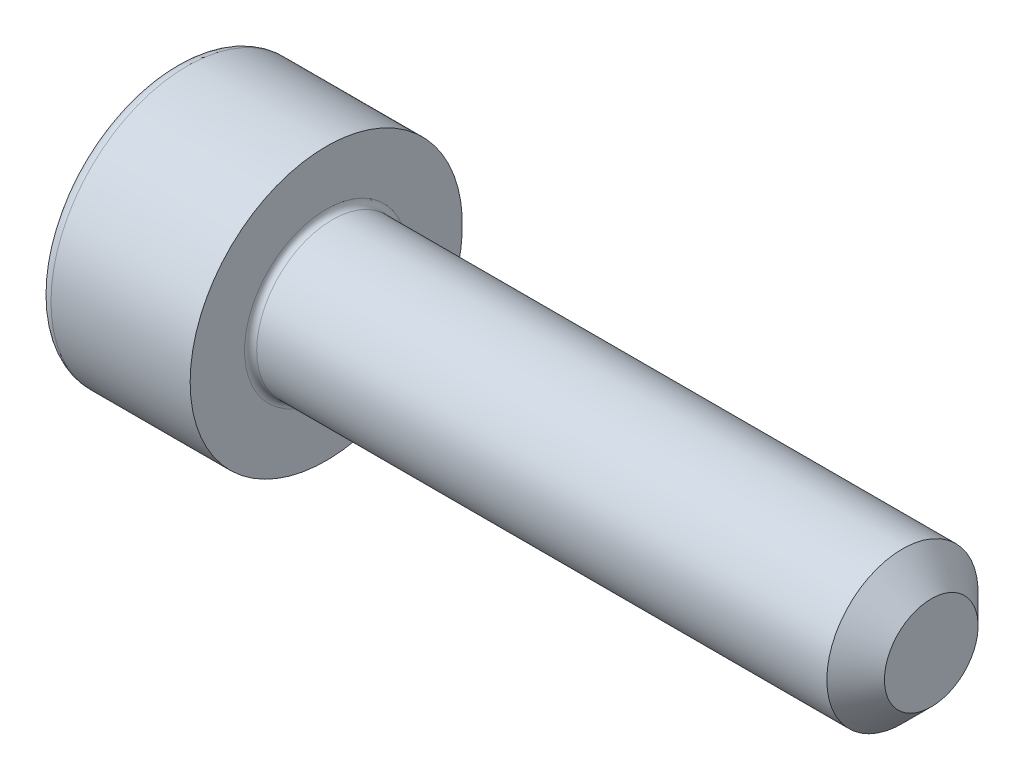
ISO-10303-21;
HEADER;
FILE_DESCRIPTION(('STEP AP214'),'2;1');
FILE_NAME('part.step','',(''),(''),'','','');
FILE_SCHEMA(('AUTOMOTIVE_DESIGN { 1 0 10303 214 1 1 1 1 }'));
ENDSEC;
DATA;
#1=APPLICATION_CONTEXT('core data for automotive mechanical design processes');
#2=APPLICATION_PROTOCOL_DEFINITION('international standard','automotive_design',2000,#1);
#3=PRODUCT_CONTEXT('',#1,'mechanical');
#4=PRODUCT('Part','Part','',(#3));
#5=PRODUCT_RELATED_PRODUCT_CATEGORY('part','',(#4));
#6=PRODUCT_DEFINITION_FORMATION('','',#4);
#7=PRODUCT_DEFINITION_CONTEXT('part definition',#1,'design');
#8=PRODUCT_DEFINITION('design','',#6,#7);
#9=PRODUCT_DEFINITION_SHAPE('','',#8);
#10=(LENGTH_UNIT() NAMED_UNIT(*) SI_UNIT(.MILLI.,.METRE.));
#11=(NAMED_UNIT(*) PLANE_ANGLE_UNIT() SI_UNIT($,.RADIAN.));
#12=(NAMED_UNIT(*) SI_UNIT($,.STERADIAN.) SOLID_ANGLE_UNIT());
#13=UNCERTAINTY_MEASURE_WITH_UNIT(LENGTH_MEASURE(1.E-05),#10,'distance_accuracy_value','');
#14=(GEOMETRIC_REPRESENTATION_CONTEXT(3) GLOBAL_UNCERTAINTY_ASSIGNED_CONTEXT((#13)) GLOBAL_UNIT_ASSIGNED_CONTEXT((#10,
#11,#12)) REPRESENTATION_CONTEXT('',''));
#15=CARTESIAN_POINT('',(0.,0.,0.));
#16=DIRECTION('',(0.,0.,1.));
#17=DIRECTION('',(1.,0.,0.));
#18=AXIS2_PLACEMENT_3D('',#15,#16,#17);
#19=CARTESIAN_POINT('',(0.,0.,0.));
#20=DIRECTION('',(-1.,0.,0.));
#21=DIRECTION('',(0.,0.,1.));
#22=AXIS2_PLACEMENT_3D('',#19,#20,#21);
#23=PLANE('',#22);
#24=DIRECTION('',(0.,-0.499999999999998,0.86602540378444));
#25=VECTOR('',#24,1.);
#26=CARTESIAN_POINT('',(0.,0.877572409168225,0.));
#27=LINE('',#26,#25);
#28=CARTESIAN_POINT('',(0.,0.877572409168225,0.));
#29=VERTEX_POINT('',#28);
#30=CARTESIAN_POINT('',(0.,0.438786204584111,0.759999999999998));
#31=VERTEX_POINT('',#30);
#32=EDGE_CURVE('E375',#29,#31,#27,.T.);
#33=ORIENTED_EDGE('',*,*,#32,.T.);
#34=DIRECTION('',(0.,1.,0.));
#35=VECTOR('',#34,1.);
#36=CARTESIAN_POINT('',(0.,-0.43878620458412,0.759999999999999));
#37=LINE('',#36,#35);
#38=CARTESIAN_POINT('',(0.,-0.43878620458412,0.759999999999999));
#39=VERTEX_POINT('',#38);
#40=EDGE_CURVE('E132',#39,#31,#37,.T.);
#41=ORIENTED_EDGE('',*,*,#40,.F.);
#42=DIRECTION('',(0.,-0.500000000000001,-0.866025403784438));
#43=VECTOR('',#42,1.);
#44=CARTESIAN_POINT('',(0.,-0.43878620458412,0.759999999999999));
#45=LINE('',#44,#43);
#46=CARTESIAN_POINT('',(0.,-0.877572409168236,0.));
#47=VERTEX_POINT('',#46);
#48=EDGE_CURVE('E378',#39,#47,#45,.T.);
#49=ORIENTED_EDGE('',*,*,#48,.T.);
#50=DIRECTION('',(0.,0.499999999999998,-0.86602540378444));
#51=VECTOR('',#50,1.);
#52=CARTESIAN_POINT('',(0.,-0.877572409168236,0.));
#53=LINE('',#52,#51);
#54=CARTESIAN_POINT('',(0.,-0.438786204584123,-0.760000000000001));
#55=VERTEX_POINT('',#54);
#56=EDGE_CURVE('E381',#47,#55,#53,.T.);
#57=ORIENTED_EDGE('',*,*,#56,.T.);
#58=DIRECTION('',(0.,-1.,0.));
#59=VECTOR('',#58,1.);
#60=CARTESIAN_POINT('',(0.,0.438786204584108,-0.760000000000002));
#61=LINE('',#60,#59);
#62=CARTESIAN_POINT('',(0.,0.438786204584108,-0.760000000000002));
#63=VERTEX_POINT('',#62);
#64=EDGE_CURVE('E384',#63,#55,#61,.T.);
#65=ORIENTED_EDGE('',*,*,#64,.F.);
#66=DIRECTION('',(0.,-0.500000000000001,-0.866025403784438));
#67=VECTOR('',#66,1.);
#68=CARTESIAN_POINT('',(0.,0.877572409168225,0.));
#69=LINE('',#68,#67);
#70=EDGE_CURVE('E127',#29,#63,#69,.T.);
#71=ORIENTED_EDGE('',*,*,#70,.F.);
#72=EDGE_LOOP('',(#33,#41,#49,#57,#65,#71));
#73=FACE_BOUND('',#72,.T.);
#74=CARTESIAN_POINT('',(0.,0.,0.));
#75=DIRECTION('',(-1.,0.,0.));
#76=DIRECTION('',(0.,0.,1.));
#77=AXIS2_PLACEMENT_3D('',#74,#75,#76);
#78=CIRCLE('',#77,2.05);
#79=CARTESIAN_POINT('',(0.,0.,2.05));
#80=VERTEX_POINT('',#79);
#81=EDGE_CURVE('E44',#80,#80,#78,.T.);
#82=ORIENTED_EDGE('',*,*,#81,.T.);
#83=EDGE_LOOP('',(#82));
#84=FACE_BOUND('',#83,.T.);
#85=ADVANCED_FACE('F36',(#73,#84),#23,.T.);
#86=CARTESIAN_POINT('',(12.5,0.774,0.));
#87=DIRECTION('',(1.,0.,0.));
#88=DIRECTION('',(0.,0.,-1.));
#89=AXIS2_PLACEMENT_3D('',#86,#87,#88);
#90=PLANE('',#89);
#91=CARTESIAN_POINT('',(12.5,0.,0.));
#92=DIRECTION('',(-1.,0.,0.));
#93=DIRECTION('',(0.,0.,1.));
#94=AXIS2_PLACEMENT_3D('',#91,#92,#93);
#95=CIRCLE('',#94,0.774);
#96=CARTESIAN_POINT('',(12.5,0.,0.774));
#97=VERTEX_POINT('',#96);
#98=EDGE_CURVE('E150',#97,#97,#95,.T.);
#99=ORIENTED_EDGE('',*,*,#98,.F.);
#100=EDGE_LOOP('',(#99));
#101=FACE_BOUND('',#100,.T.);
#102=ADVANCED_FACE('F174',(#101),#90,.T.);
#103=CARTESIAN_POINT('',(12.5,0.,0.));
#104=DIRECTION('',(-1.,0.,0.));
#105=DIRECTION('',(0.,0.,1.));
#106=AXIS2_PLACEMENT_3D('',#103,#104,#105);
#107=CONICAL_SURFACE('',#106,0.774,0.785398163397458);
#108=CARTESIAN_POINT('',(12.024,0.,0.));
#109=DIRECTION('',(-1.,0.,0.));
#110=DIRECTION('',(0.,0.,1.));
#111=AXIS2_PLACEMENT_3D('',#108,#109,#110);
#112=CIRCLE('',#111,1.25);
#113=CARTESIAN_POINT('',(12.024,0.,1.25));
#114=VERTEX_POINT('',#113);
#115=EDGE_CURVE('E147',#114,#114,#112,.T.);
#116=ORIENTED_EDGE('',*,*,#115,.F.);
#117=EDGE_LOOP('',(#116));
#118=FACE_BOUND('',#117,.T.);
#119=ORIENTED_EDGE('',*,*,#98,.T.);
#120=EDGE_LOOP('',(#119));
#121=FACE_BOUND('',#120,.T.);
#122=ADVANCED_FACE('F180',(#118,#121),#107,.T.);
#123=CARTESIAN_POINT('',(-31.75,0.,0.));
#124=DIRECTION('',(-1.,0.,0.));
#125=DIRECTION('',(0.,0.,1.));
#126=AXIS2_PLACEMENT_3D('',#123,#124,#125);
#127=CYLINDRICAL_SURFACE('',#126,1.25);
#128=CARTESIAN_POINT('',(2.6,0.,0.));
#129=DIRECTION('',(1.,0.,0.));
#130=DIRECTION('',(0.,0.,-1.));
#131=AXIS2_PLACEMENT_3D('',#128,#129,#130);
#132=CIRCLE('',#131,1.25);
#133=CARTESIAN_POINT('',(2.6,0.,-1.25));
#134=VERTEX_POINT('',#133);
#135=EDGE_CURVE('E156',#134,#134,#132,.T.);
#136=ORIENTED_EDGE('',*,*,#135,.T.);
#137=EDGE_LOOP('',(#136));
#138=FACE_BOUND('',#137,.T.);
#139=ORIENTED_EDGE('',*,*,#115,.T.);
#140=EDGE_LOOP('',(#139));
#141=FACE_BOUND('',#140,.T.);
#142=ADVANCED_FACE('F192',(#138,#141),#127,.T.);
#143=CARTESIAN_POINT('',(2.5,2.25,0.));
#144=DIRECTION('',(1.,0.,0.));
#145=DIRECTION('',(0.,0.,-1.));
#146=AXIS2_PLACEMENT_3D('',#143,#144,#145);
#147=PLANE('',#146);
#148=CARTESIAN_POINT('',(2.5,0.,0.));
#149=DIRECTION('',(1.,0.,0.));
#150=DIRECTION('',(0.,0.,-1.));
#151=AXIS2_PLACEMENT_3D('',#148,#149,#150);
#152=CIRCLE('',#151,1.35);
#153=CARTESIAN_POINT('',(2.5,0.,-1.35));
#154=VERTEX_POINT('',#153);
#155=EDGE_CURVE('E153',#154,#154,#152,.F.);
#156=ORIENTED_EDGE('',*,*,#155,.T.);
#157=EDGE_LOOP('',(#156));
#158=FACE_BOUND('',#157,.T.);
#159=CARTESIAN_POINT('',(2.5,0.,0.));
#160=DIRECTION('',(-1.,0.,0.));
#161=DIRECTION('',(0.,0.,1.));
#162=AXIS2_PLACEMENT_3D('',#159,#160,#161);
#163=CIRCLE('',#162,2.25);
#164=CARTESIAN_POINT('',(2.5,0.,2.25));
#165=VERTEX_POINT('',#164);
#166=EDGE_CURVE('E143',#165,#165,#163,.T.);
#167=ORIENTED_EDGE('',*,*,#166,.F.);
#168=EDGE_LOOP('',(#167));
#169=FACE_BOUND('',#168,.T.);
#170=ADVANCED_FACE('F188',(#158,#169),#147,.T.);
#171=CARTESIAN_POINT('',(-31.75,0.,0.));
#172=DIRECTION('',(-1.,0.,0.));
#173=DIRECTION('',(0.,0.,1.));
#174=AXIS2_PLACEMENT_3D('',#171,#172,#173);
#175=CYLINDRICAL_SURFACE('',#174,2.25);
#176=CARTESIAN_POINT('',(0.199999999999999,0.,0.));
#177=DIRECTION('',(-1.,0.,0.));
#178=DIRECTION('',(0.,0.,1.));
#179=AXIS2_PLACEMENT_3D('',#176,#177,#178);
#180=CIRCLE('',#179,2.25);
#181=CARTESIAN_POINT('',(0.199999999999999,0.,2.25));
#182=VERTEX_POINT('',#181);
#183=EDGE_CURVE('E11',#182,#182,#180,.F.);
#184=ORIENTED_EDGE('',*,*,#183,.T.);
#185=EDGE_LOOP('',(#184));
#186=FACE_BOUND('',#185,.T.);
#187=ORIENTED_EDGE('',*,*,#166,.T.);
#188=EDGE_LOOP('',(#187));
#189=FACE_BOUND('',#188,.T.);
#190=ADVANCED_FACE('F170',(#186,#189),#175,.T.);
#191=CARTESIAN_POINT('',(2.6,0.,0.));
#192=DIRECTION('',(1.,0.,0.));
#193=DIRECTION('',(0.,0.,-1.));
#194=AXIS2_PLACEMENT_3D('',#191,#192,#193);
#195=TOROIDAL_SURFACE('',#194,1.35,0.1);
#196=ORIENTED_EDGE('',*,*,#135,.F.);
#197=EDGE_LOOP('',(#196));
#198=FACE_BOUND('',#197,.T.);
#199=ORIENTED_EDGE('',*,*,#155,.F.);
#200=EDGE_LOOP('',(#199));
#201=FACE_BOUND('',#200,.T.);
#202=ADVANCED_FACE('F163',(#198,#201),#195,.F.);
#203=CARTESIAN_POINT('',(0.199999999999999,0.,0.));
#204=DIRECTION('',(-1.,0.,0.));
#205=DIRECTION('',(0.,0.,1.));
#206=AXIS2_PLACEMENT_3D('',#203,#204,#205);
#207=TOROIDAL_SURFACE('',#206,2.05,0.2);
#208=ORIENTED_EDGE('',*,*,#183,.F.);
#209=EDGE_LOOP('',(#208));
#210=FACE_BOUND('',#209,.T.);
#211=ORIENTED_EDGE('',*,*,#81,.F.);
#212=EDGE_LOOP('',(#211));
#213=FACE_BOUND('',#212,.T.);
#214=ADVANCED_FACE('F38',(#210,#213),#207,.T.);
#215=CARTESIAN_POINT('',(1.,0.877572409168225,0.));
#216=DIRECTION('',(0.,-0.86602540378444,-0.499999999999998));
#217=DIRECTION('',(0.,0.499999999999998,-0.86602540378444));
#218=AXIS2_PLACEMENT_3D('',#215,#216,#217);
#219=PLANE('',#218);
#220=ORIENTED_EDGE('',*,*,#32,.F.);
#221=DIRECTION('',(-1.,0.,0.));
#222=VECTOR('',#221,1.);
#223=CARTESIAN_POINT('',(1.,0.877572409168225,0.));
#224=LINE('',#223,#222);
#225=CARTESIAN_POINT('',(1.,0.877572409168225,0.));
#226=VERTEX_POINT('',#225);
#227=EDGE_CURVE('E365',#226,#29,#224,.T.);
#228=ORIENTED_EDGE('',*,*,#227,.F.);
#229=DIRECTION('',(0.,-0.499999999999998,0.86602540378444));
#230=VECTOR('',#229,1.);
#231=CARTESIAN_POINT('',(1.,0.877572409168225,0.));
#232=LINE('',#231,#230);
#233=CARTESIAN_POINT('',(1.,0.658179306876169,0.379999999999996));
#234=VERTEX_POINT('',#233);
#235=EDGE_CURVE('E119',#226,#234,#232,.T.);
#236=ORIENTED_EDGE('',*,*,#235,.T.);
#237=CARTESIAN_POINT('',(1.,0.438786204584111,0.759999999999998));
#238=VERTEX_POINT('',#237);
#239=EDGE_CURVE('E110',#234,#238,#232,.T.);
#240=ORIENTED_EDGE('',*,*,#239,.T.);
#241=DIRECTION('',(-1.,0.,0.));
#242=VECTOR('',#241,1.);
#243=CARTESIAN_POINT('',(1.,0.438786204584111,0.759999999999998));
#244=LINE('',#243,#242);
#245=EDGE_CURVE('E124',#238,#31,#244,.T.);
#246=ORIENTED_EDGE('',*,*,#245,.T.);
#247=EDGE_LOOP('',(#220,#228,#236,#240,#246));
#248=FACE_BOUND('',#247,.T.);
#249=ADVANCED_FACE('F123',(#248),#219,.T.);
#250=CARTESIAN_POINT('',(1.,-0.43878620458412,0.759999999999999));
#251=DIRECTION('',(0.,0.,1.));
#252=DIRECTION('',(0.,-1.,0.));
#253=AXIS2_PLACEMENT_3D('',#250,#251,#252);
#254=PLANE('',#253);
#255=ORIENTED_EDGE('',*,*,#40,.T.);
#256=ORIENTED_EDGE('',*,*,#245,.F.);
#257=DIRECTION('',(0.,1.,0.));
#258=VECTOR('',#257,1.);
#259=CARTESIAN_POINT('',(1.,-0.43878620458412,0.759999999999999));
#260=LINE('',#259,#258);
#261=CARTESIAN_POINT('',(1.,0.,0.759999999999998));
#262=VERTEX_POINT('',#261);
#263=EDGE_CURVE('E107',#262,#238,#260,.T.);
#264=ORIENTED_EDGE('',*,*,#263,.F.);
#265=CARTESIAN_POINT('',(1.,-0.43878620458412,0.759999999999999));
#266=VERTEX_POINT('',#265);
#267=EDGE_CURVE('E118',#266,#262,#260,.T.);
#268=ORIENTED_EDGE('',*,*,#267,.F.);
#269=DIRECTION('',(-1.,0.,0.));
#270=VECTOR('',#269,1.);
#271=CARTESIAN_POINT('',(1.,-0.43878620458412,0.759999999999999));
#272=LINE('',#271,#270);
#273=EDGE_CURVE('E134',#266,#39,#272,.T.);
#274=ORIENTED_EDGE('',*,*,#273,.T.);
#275=EDGE_LOOP('',(#255,#256,#264,#268,#274));
#276=FACE_BOUND('',#275,.T.);
#277=ADVANCED_FACE('F129',(#276),#254,.F.);
#278=CARTESIAN_POINT('',(1.,-0.43878620458412,0.759999999999999));
#279=DIRECTION('',(0.,0.866025403784438,-0.500000000000001));
#280=DIRECTION('',(0.,0.500000000000001,0.866025403784438));
#281=AXIS2_PLACEMENT_3D('',#278,#279,#280);
#282=PLANE('',#281);
#283=ORIENTED_EDGE('',*,*,#48,.F.);
#284=ORIENTED_EDGE('',*,*,#273,.F.);
#285=DIRECTION('',(0.,-0.500000000000001,-0.866025403784438));
#286=VECTOR('',#285,1.);
#287=CARTESIAN_POINT('',(1.,-0.43878620458412,0.759999999999999));
#288=LINE('',#287,#286);
#289=CARTESIAN_POINT('',(1.,-0.658179306876176,0.380000000000003));
#290=VERTEX_POINT('',#289);
#291=EDGE_CURVE('E404',#266,#290,#288,.T.);
#292=ORIENTED_EDGE('',*,*,#291,.T.);
#293=CARTESIAN_POINT('',(1.,-0.877572409168236,0.));
#294=VERTEX_POINT('',#293);
#295=EDGE_CURVE('E393',#290,#294,#288,.T.);
#296=ORIENTED_EDGE('',*,*,#295,.T.);
#297=DIRECTION('',(-1.,0.,0.));
#298=VECTOR('',#297,1.);
#299=CARTESIAN_POINT('',(1.,-0.877572409168236,0.));
#300=LINE('',#299,#298);
#301=EDGE_CURVE('E139',#294,#47,#300,.T.);
#302=ORIENTED_EDGE('',*,*,#301,.T.);
#303=EDGE_LOOP('',(#283,#284,#292,#296,#302));
#304=FACE_BOUND('',#303,.T.);
#305=ADVANCED_FACE('F256',(#304),#282,.T.);
#306=CARTESIAN_POINT('',(1.,-0.877572409168236,0.));
#307=DIRECTION('',(0.,0.86602540378444,0.499999999999998));
#308=DIRECTION('',(0.,-0.499999999999998,0.86602540378444));
#309=AXIS2_PLACEMENT_3D('',#306,#307,#308);
#310=PLANE('',#309);
#311=ORIENTED_EDGE('',*,*,#56,.F.);
#312=ORIENTED_EDGE('',*,*,#301,.F.);
#313=DIRECTION('',(0.,0.499999999999998,-0.86602540378444));
#314=VECTOR('',#313,1.);
#315=CARTESIAN_POINT('',(1.,-0.877572409168236,0.));
#316=LINE('',#315,#314);
#317=CARTESIAN_POINT('',(1.,-0.658179306876179,-0.380000000000001));
#318=VERTEX_POINT('',#317);
#319=EDGE_CURVE('E371',#294,#318,#316,.T.);
#320=ORIENTED_EDGE('',*,*,#319,.T.);
#321=CARTESIAN_POINT('',(1.,-0.438786204584123,-0.760000000000001));
#322=VERTEX_POINT('',#321);
#323=EDGE_CURVE('E403',#318,#322,#316,.T.);
#324=ORIENTED_EDGE('',*,*,#323,.T.);
#325=DIRECTION('',(-1.,0.,0.));
#326=VECTOR('',#325,1.);
#327=CARTESIAN_POINT('',(1.,-0.438786204584123,-0.760000000000001));
#328=LINE('',#327,#326);
#329=EDGE_CURVE('E364',#322,#55,#328,.T.);
#330=ORIENTED_EDGE('',*,*,#329,.T.);
#331=EDGE_LOOP('',(#311,#312,#320,#324,#330));
#332=FACE_BOUND('',#331,.T.);
#333=ADVANCED_FACE('F264',(#332),#310,.T.);
#334=CARTESIAN_POINT('',(1.,0.438786204584108,-0.760000000000002));
#335=DIRECTION('',(0.,0.,-1.));
#336=DIRECTION('',(0.,1.,0.));
#337=AXIS2_PLACEMENT_3D('',#334,#335,#336);
#338=PLANE('',#337);
#339=ORIENTED_EDGE('',*,*,#64,.T.);
#340=ORIENTED_EDGE('',*,*,#329,.F.);
#341=DIRECTION('',(0.,-1.,0.));
#342=VECTOR('',#341,1.);
#343=CARTESIAN_POINT('',(1.,0.438786204584108,-0.760000000000002));
#344=LINE('',#343,#342);
#345=CARTESIAN_POINT('',(1.,0.,-0.76));
#346=VERTEX_POINT('',#345);
#347=EDGE_CURVE('E368',#346,#322,#344,.T.);
#348=ORIENTED_EDGE('',*,*,#347,.F.);
#349=CARTESIAN_POINT('',(1.,0.438786204584108,-0.760000000000002));
#350=VERTEX_POINT('',#349);
#351=EDGE_CURVE('E51',#350,#346,#344,.T.);
#352=ORIENTED_EDGE('',*,*,#351,.F.);
#353=DIRECTION('',(-1.,0.,0.));
#354=VECTOR('',#353,1.);
#355=CARTESIAN_POINT('',(1.,0.438786204584108,-0.760000000000002));
#356=LINE('',#355,#354);
#357=EDGE_CURVE('E361',#350,#63,#356,.T.);
#358=ORIENTED_EDGE('',*,*,#357,.T.);
#359=EDGE_LOOP('',(#339,#340,#348,#352,#358));
#360=FACE_BOUND('',#359,.T.);
#361=ADVANCED_FACE('F273',(#360),#338,.F.);
#362=CARTESIAN_POINT('',(1.,0.877572409168225,0.));
#363=DIRECTION('',(0.,0.866025403784438,-0.500000000000001));
#364=DIRECTION('',(0.,0.500000000000001,0.866025403784438));
#365=AXIS2_PLACEMENT_3D('',#362,#363,#364);
#366=PLANE('',#365);
#367=ORIENTED_EDGE('',*,*,#70,.T.);
#368=ORIENTED_EDGE('',*,*,#357,.F.);
#369=DIRECTION('',(0.,-0.500000000000001,-0.866025403784438));
#370=VECTOR('',#369,1.);
#371=CARTESIAN_POINT('',(1.,0.877572409168225,0.));
#372=LINE('',#371,#370);
#373=CARTESIAN_POINT('',(1.,0.658179306876168,-0.379999999999998));
#374=VERTEX_POINT('',#373);
#375=EDGE_CURVE('E351',#374,#350,#372,.T.);
#376=ORIENTED_EDGE('',*,*,#375,.F.);
#377=EDGE_CURVE('E357',#226,#374,#372,.T.);
#378=ORIENTED_EDGE('',*,*,#377,.F.);
#379=ORIENTED_EDGE('',*,*,#227,.T.);
#380=EDGE_LOOP('',(#367,#368,#376,#378,#379));
#381=FACE_BOUND('',#380,.T.);
#382=ADVANCED_FACE('F282',(#381),#366,.F.);
#383=CARTESIAN_POINT('',(1.,1.31635861375234,-0.760000000000003));
#384=DIRECTION('',(1.,0.,0.));
#385=DIRECTION('',(0.,0.,-1.));
#386=AXIS2_PLACEMENT_3D('',#383,#384,#385);
#387=PLANE('',#386);
#388=ORIENTED_EDGE('',*,*,#347,.T.);
#389=ORIENTED_EDGE('',*,*,#323,.F.);
#390=CARTESIAN_POINT('',(1.,0.,0.));
#391=DIRECTION('',(-1.,0.,0.));
#392=DIRECTION('',(0.,0.,1.));
#393=AXIS2_PLACEMENT_3D('',#390,#391,#392);
#394=CIRCLE('',#393,0.76);
#395=EDGE_CURVE('E399',#346,#318,#394,.T.);
#396=ORIENTED_EDGE('',*,*,#395,.F.);
#397=EDGE_LOOP('',(#388,#389,#396));
#398=FACE_BOUND('',#397,.T.);
#399=ADVANCED_FACE('F291',(#398),#387,.F.);
#400=ORIENTED_EDGE('',*,*,#319,.F.);
#401=ORIENTED_EDGE('',*,*,#295,.F.);
#402=EDGE_CURVE('E137',#318,#290,#394,.T.);
#403=ORIENTED_EDGE('',*,*,#402,.F.);
#404=EDGE_LOOP('',(#400,#401,#403));
#405=FACE_BOUND('',#404,.T.);
#406=ADVANCED_FACE('F300',(#405),#387,.F.);
#407=ORIENTED_EDGE('',*,*,#291,.F.);
#408=ORIENTED_EDGE('',*,*,#267,.T.);
#409=EDGE_CURVE('E133',#290,#262,#394,.T.);
#410=ORIENTED_EDGE('',*,*,#409,.F.);
#411=EDGE_LOOP('',(#407,#408,#410));
#412=FACE_BOUND('',#411,.T.);
#413=ADVANCED_FACE('F309',(#412),#387,.F.);
#414=ORIENTED_EDGE('',*,*,#263,.T.);
#415=ORIENTED_EDGE('',*,*,#239,.F.);
#416=EDGE_CURVE('E113',#262,#234,#394,.T.);
#417=ORIENTED_EDGE('',*,*,#416,.F.);
#418=EDGE_LOOP('',(#414,#415,#417));
#419=FACE_BOUND('',#418,.T.);
#420=ADVANCED_FACE('F109',(#419),#387,.F.);
#421=ORIENTED_EDGE('',*,*,#235,.F.);
#422=ORIENTED_EDGE('',*,*,#377,.T.);
#423=EDGE_CURVE('E144',#234,#374,#394,.T.);
#424=ORIENTED_EDGE('',*,*,#423,.F.);
#425=EDGE_LOOP('',(#421,#422,#424));
#426=FACE_BOUND('',#425,.T.);
#427=ADVANCED_FACE('F324',(#426),#387,.F.);
#428=ORIENTED_EDGE('',*,*,#375,.T.);
#429=ORIENTED_EDGE('',*,*,#351,.T.);
#430=EDGE_CURVE('E354',#374,#346,#394,.T.);
#431=ORIENTED_EDGE('',*,*,#430,.F.);
#432=EDGE_LOOP('',(#428,#429,#431));
#433=FACE_BOUND('',#432,.T.);
#434=ADVANCED_FACE('F239',(#433),#387,.F.);
#435=CARTESIAN_POINT('',(1.,0.,0.));
#436=DIRECTION('',(-1.,0.,0.));
#437=DIRECTION('',(0.,0.,1.));
#438=AXIS2_PLACEMENT_3D('',#435,#436,#437);
#439=CONICAL_SURFACE('',#438,0.76,1.0471975511966);
#440=CARTESIAN_POINT('',(1.43878620458412,0.,0.));
#441=VERTEX_POINT('',#440);
#442=VERTEX_LOOP('',#441);
#443=FACE_BOUND('',#442,.T.);
#444=ORIENTED_EDGE('',*,*,#416,.T.);
#445=ORIENTED_EDGE('',*,*,#423,.T.);
#446=ORIENTED_EDGE('',*,*,#430,.T.);
#447=ORIENTED_EDGE('',*,*,#395,.T.);
#448=ORIENTED_EDGE('',*,*,#402,.T.);
#449=ORIENTED_EDGE('',*,*,#409,.T.);
#450=EDGE_LOOP('',(#444,#445,#446,#447,#448,#449));
#451=FACE_BOUND('',#450,.T.);
#452=ADVANCED_FACE('F185',(#443,#451),#439,.F.);
#453=CLOSED_SHELL('',(#85,#102,#122,#142,#170,#190,#202,#214,#249,#277,#305,#333,#361,#382,#399,
#406,#413,#420,#427,#434,#452));
#454=MANIFOLD_SOLID_BREP('B2',#453);
#455=ADVANCED_BREP_SHAPE_REPRESENTATION('',(#18,#454),#14);
#456=SHAPE_DEFINITION_REPRESENTATION(#9,#455);
ENDSEC;
END-ISO-10303-21;
